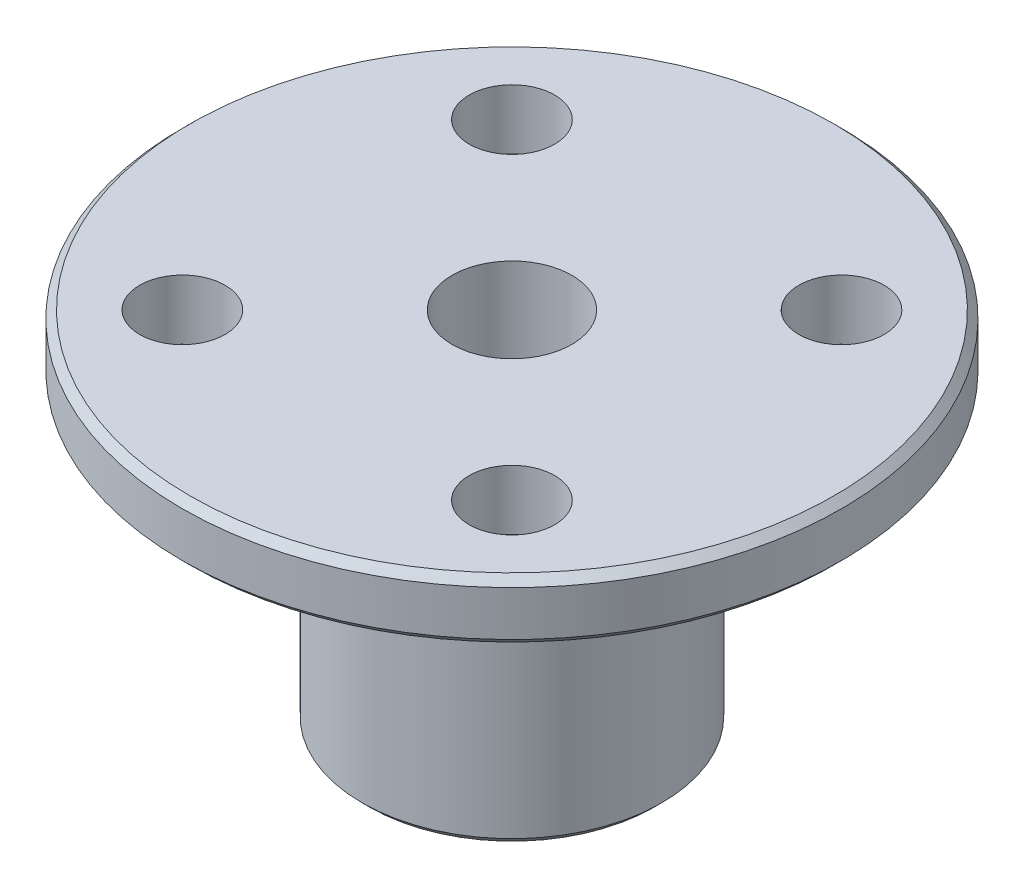
ISO-10303-21;
HEADER;
FILE_DESCRIPTION(('STEP AP214'),'2;1');
FILE_NAME('part.step','',(''),(''),'','','');
FILE_SCHEMA(('AUTOMOTIVE_DESIGN { 1 0 10303 214 1 1 1 1 }'));
ENDSEC;
DATA;
#1=APPLICATION_CONTEXT('core data for automotive mechanical design processes');
#2=APPLICATION_PROTOCOL_DEFINITION('international standard','automotive_design',2000,#1);
#3=PRODUCT_CONTEXT('',#1,'mechanical');
#4=PRODUCT('Part','Part','',(#3));
#5=PRODUCT_RELATED_PRODUCT_CATEGORY('part','',(#4));
#6=PRODUCT_DEFINITION_FORMATION('','',#4);
#7=PRODUCT_DEFINITION_CONTEXT('part definition',#1,'design');
#8=PRODUCT_DEFINITION('design','',#6,#7);
#9=PRODUCT_DEFINITION_SHAPE('','',#8);
#10=(LENGTH_UNIT() NAMED_UNIT(*) SI_UNIT(.MILLI.,.METRE.));
#11=(NAMED_UNIT(*) PLANE_ANGLE_UNIT() SI_UNIT($,.RADIAN.));
#12=(NAMED_UNIT(*) SI_UNIT($,.STERADIAN.) SOLID_ANGLE_UNIT());
#13=UNCERTAINTY_MEASURE_WITH_UNIT(LENGTH_MEASURE(1.E-05),#10,'distance_accuracy_value','');
#14=(GEOMETRIC_REPRESENTATION_CONTEXT(3) GLOBAL_UNCERTAINTY_ASSIGNED_CONTEXT((#13)) GLOBAL_UNIT_ASSIGNED_CONTEXT((#10,
#11,#12)) REPRESENTATION_CONTEXT('',''));
#15=CARTESIAN_POINT('',(0.,0.,0.));
#16=DIRECTION('',(0.,0.,1.));
#17=DIRECTION('',(1.,0.,0.));
#18=AXIS2_PLACEMENT_3D('',#15,#16,#17);
#19=CARTESIAN_POINT('',(0.,-2.,0.));
#20=DIRECTION('',(0.,1.,0.));
#21=DIRECTION('',(0.,0.,1.));
#22=AXIS2_PLACEMENT_3D('',#19,#20,#21);
#23=CYLINDRICAL_SURFACE('',#22,11.);
#24=CARTESIAN_POINT('',(0.,-1.75,0.));
#25=DIRECTION('',(0.,1.,0.));
#26=DIRECTION('',(0.,0.,1.));
#27=AXIS2_PLACEMENT_3D('',#24,#25,#26);
#28=CIRCLE('',#27,11.);
#29=CARTESIAN_POINT('',(0.,-1.75,11.));
#30=VERTEX_POINT('',#29);
#31=EDGE_CURVE('E49',#30,#30,#28,.T.);
#32=ORIENTED_EDGE('',*,*,#31,.T.);
#33=EDGE_LOOP('',(#32));
#34=FACE_BOUND('',#33,.T.);
#35=CARTESIAN_POINT('',(0.,-0.250000000000011,0.));
#36=DIRECTION('',(0.,1.,0.));
#37=DIRECTION('',(0.,0.,1.));
#38=AXIS2_PLACEMENT_3D('',#35,#36,#37);
#39=CIRCLE('',#38,11.);
#40=CARTESIAN_POINT('',(0.,-0.250000000000011,11.));
#41=VERTEX_POINT('',#40);
#42=EDGE_CURVE('E53',#41,#41,#39,.F.);
#43=ORIENTED_EDGE('',*,*,#42,.T.);
#44=EDGE_LOOP('',(#43));
#45=FACE_BOUND('',#44,.T.);
#46=ADVANCED_FACE('F41',(#34,#45),#23,.T.);
#47=CARTESIAN_POINT('',(-5.5,-2.,-5.5));
#48=DIRECTION('',(0.,1.,0.));
#49=DIRECTION('',(0.,0.,1.));
#50=AXIS2_PLACEMENT_3D('',#47,#48,#49);
#51=CYLINDRICAL_SURFACE('',#50,1.425);
#52=CARTESIAN_POINT('',(-5.5,-2.,-5.5));
#53=DIRECTION('',(0.,1.,0.));
#54=DIRECTION('',(0.,0.,1.));
#55=AXIS2_PLACEMENT_3D('',#52,#53,#54);
#56=CIRCLE('',#55,1.425);
#57=CARTESIAN_POINT('',(-5.5,-2.,-4.075));
#58=VERTEX_POINT('',#57);
#59=EDGE_CURVE('E80',#58,#58,#56,.T.);
#60=ORIENTED_EDGE('',*,*,#59,.F.);
#61=EDGE_LOOP('',(#60));
#62=FACE_BOUND('',#61,.T.);
#63=CARTESIAN_POINT('',(-5.5,0.,-5.5));
#64=DIRECTION('',(0.,1.,0.));
#65=DIRECTION('',(0.,0.,1.));
#66=AXIS2_PLACEMENT_3D('',#63,#64,#65);
#67=CIRCLE('',#66,1.425);
#68=CARTESIAN_POINT('',(-5.5,0.,-4.075));
#69=VERTEX_POINT('',#68);
#70=EDGE_CURVE('E85',#69,#69,#67,.T.);
#71=ORIENTED_EDGE('',*,*,#70,.T.);
#72=EDGE_LOOP('',(#71));
#73=FACE_BOUND('',#72,.T.);
#74=ADVANCED_FACE('F142',(#62,#73),#51,.F.);
#75=CARTESIAN_POINT('',(5.5,-2.,5.5));
#76=DIRECTION('',(0.,1.,0.));
#77=DIRECTION('',(0.,0.,1.));
#78=AXIS2_PLACEMENT_3D('',#75,#76,#77);
#79=CYLINDRICAL_SURFACE('',#78,1.425);
#80=CARTESIAN_POINT('',(5.5,-2.,5.5));
#81=DIRECTION('',(0.,1.,0.));
#82=DIRECTION('',(0.,0.,1.));
#83=AXIS2_PLACEMENT_3D('',#80,#81,#82);
#84=CIRCLE('',#83,1.425);
#85=CARTESIAN_POINT('',(5.5,-2.,6.925));
#86=VERTEX_POINT('',#85);
#87=EDGE_CURVE('E99',#86,#86,#84,.T.);
#88=ORIENTED_EDGE('',*,*,#87,.F.);
#89=EDGE_LOOP('',(#88));
#90=FACE_BOUND('',#89,.T.);
#91=CARTESIAN_POINT('',(5.5,0.,5.5));
#92=DIRECTION('',(0.,1.,0.));
#93=DIRECTION('',(0.,0.,1.));
#94=AXIS2_PLACEMENT_3D('',#91,#92,#93);
#95=CIRCLE('',#94,1.425);
#96=CARTESIAN_POINT('',(5.5,0.,6.925));
#97=VERTEX_POINT('',#96);
#98=EDGE_CURVE('E88',#97,#97,#95,.T.);
#99=ORIENTED_EDGE('',*,*,#98,.T.);
#100=EDGE_LOOP('',(#99));
#101=FACE_BOUND('',#100,.T.);
#102=ADVANCED_FACE('F146',(#90,#101),#79,.F.);
#103=CARTESIAN_POINT('',(5.5,-2.,-5.5));
#104=DIRECTION('',(0.,1.,0.));
#105=DIRECTION('',(0.,0.,1.));
#106=AXIS2_PLACEMENT_3D('',#103,#104,#105);
#107=CYLINDRICAL_SURFACE('',#106,1.425);
#108=CARTESIAN_POINT('',(5.5,-2.,-5.5));
#109=DIRECTION('',(0.,1.,0.));
#110=DIRECTION('',(0.,0.,1.));
#111=AXIS2_PLACEMENT_3D('',#108,#109,#110);
#112=CIRCLE('',#111,1.425);
#113=CARTESIAN_POINT('',(5.5,-2.,-4.075));
#114=VERTEX_POINT('',#113);
#115=EDGE_CURVE('E102',#114,#114,#112,.T.);
#116=ORIENTED_EDGE('',*,*,#115,.F.);
#117=EDGE_LOOP('',(#116));
#118=FACE_BOUND('',#117,.T.);
#119=CARTESIAN_POINT('',(5.5,0.,-5.5));
#120=DIRECTION('',(0.,1.,0.));
#121=DIRECTION('',(0.,0.,1.));
#122=AXIS2_PLACEMENT_3D('',#119,#120,#121);
#123=CIRCLE('',#122,1.425);
#124=CARTESIAN_POINT('',(5.5,0.,-4.075));
#125=VERTEX_POINT('',#124);
#126=EDGE_CURVE('E91',#125,#125,#123,.T.);
#127=ORIENTED_EDGE('',*,*,#126,.T.);
#128=EDGE_LOOP('',(#127));
#129=FACE_BOUND('',#128,.T.);
#130=ADVANCED_FACE('F115',(#118,#129),#107,.F.);
#131=CARTESIAN_POINT('',(-5.5,-2.,5.5));
#132=DIRECTION('',(0.,1.,0.));
#133=DIRECTION('',(0.,0.,1.));
#134=AXIS2_PLACEMENT_3D('',#131,#132,#133);
#135=CYLINDRICAL_SURFACE('',#134,1.425);
#136=CARTESIAN_POINT('',(-5.5,-2.,5.5));
#137=DIRECTION('',(0.,1.,0.));
#138=DIRECTION('',(0.,0.,1.));
#139=AXIS2_PLACEMENT_3D('',#136,#137,#138);
#140=CIRCLE('',#139,1.425);
#141=CARTESIAN_POINT('',(-5.5,-2.,6.925));
#142=VERTEX_POINT('',#141);
#143=EDGE_CURVE('E84',#142,#142,#140,.T.);
#144=ORIENTED_EDGE('',*,*,#143,.F.);
#145=EDGE_LOOP('',(#144));
#146=FACE_BOUND('',#145,.T.);
#147=CARTESIAN_POINT('',(-5.5,0.,5.5));
#148=DIRECTION('',(0.,1.,0.));
#149=DIRECTION('',(0.,0.,1.));
#150=AXIS2_PLACEMENT_3D('',#147,#148,#149);
#151=CIRCLE('',#150,1.425);
#152=CARTESIAN_POINT('',(-5.5,0.,6.925));
#153=VERTEX_POINT('',#152);
#154=EDGE_CURVE('E94',#153,#153,#151,.T.);
#155=ORIENTED_EDGE('',*,*,#154,.T.);
#156=EDGE_LOOP('',(#155));
#157=FACE_BOUND('',#156,.T.);
#158=ADVANCED_FACE('F111',(#146,#157),#135,.F.);
#159=CARTESIAN_POINT('',(0.,-2.,0.));
#160=DIRECTION('',(0.,1.,0.));
#161=DIRECTION('',(0.,0.,1.));
#162=AXIS2_PLACEMENT_3D('',#159,#160,#161);
#163=CYLINDRICAL_SURFACE('',#162,2.);
#164=CARTESIAN_POINT('',(0.,-11.75,0.));
#165=DIRECTION('',(0.,1.,0.));
#166=DIRECTION('',(0.,0.,1.));
#167=AXIS2_PLACEMENT_3D('',#164,#165,#166);
#168=CIRCLE('',#167,2.);
#169=CARTESIAN_POINT('',(0.,-11.75,2.));
#170=VERTEX_POINT('',#169);
#171=EDGE_CURVE('E71',#170,#170,#168,.F.);
#172=ORIENTED_EDGE('',*,*,#171,.T.);
#173=EDGE_LOOP('',(#172));
#174=FACE_BOUND('',#173,.T.);
#175=CARTESIAN_POINT('',(0.,0.,0.));
#176=DIRECTION('',(0.,1.,0.));
#177=DIRECTION('',(0.,0.,1.));
#178=AXIS2_PLACEMENT_3D('',#175,#176,#177);
#179=CIRCLE('',#178,2.);
#180=CARTESIAN_POINT('',(0.,0.,2.));
#181=VERTEX_POINT('',#180);
#182=EDGE_CURVE('E81',#181,#181,#179,.T.);
#183=ORIENTED_EDGE('',*,*,#182,.T.);
#184=EDGE_LOOP('',(#183));
#185=FACE_BOUND('',#184,.T.);
#186=ADVANCED_FACE('F114',(#174,#185),#163,.F.);
#187=CARTESIAN_POINT('',(0.,-2.,0.));
#188=DIRECTION('',(0.,1.,0.));
#189=DIRECTION('',(0.,0.,1.));
#190=AXIS2_PLACEMENT_3D('',#187,#188,#189);
#191=PLANE('',#190);
#192=CARTESIAN_POINT('',(0.,-2.,0.));
#193=DIRECTION('',(0.,1.,0.));
#194=DIRECTION('',(0.,0.,1.));
#195=AXIS2_PLACEMENT_3D('',#192,#193,#194);
#196=CIRCLE('',#195,5.25);
#197=CARTESIAN_POINT('',(0.,-2.,5.25));
#198=VERTEX_POINT('',#197);
#199=EDGE_CURVE('E65',#198,#198,#196,.T.);
#200=ORIENTED_EDGE('',*,*,#199,.T.);
#201=EDGE_LOOP('',(#200));
#202=FACE_BOUND('',#201,.T.);
#203=CARTESIAN_POINT('',(0.,-2.,0.));
#204=DIRECTION('',(0.,1.,0.));
#205=DIRECTION('',(0.,0.,1.));
#206=AXIS2_PLACEMENT_3D('',#203,#204,#205);
#207=CIRCLE('',#206,10.75);
#208=CARTESIAN_POINT('',(0.,-2.,10.75));
#209=VERTEX_POINT('',#208);
#210=EDGE_CURVE('E68',#209,#209,#207,.F.);
#211=ORIENTED_EDGE('',*,*,#210,.T.);
#212=EDGE_LOOP('',(#211));
#213=FACE_BOUND('',#212,.T.);
#214=ORIENTED_EDGE('',*,*,#143,.T.);
#215=EDGE_LOOP('',(#214));
#216=FACE_BOUND('',#215,.T.);
#217=ORIENTED_EDGE('',*,*,#115,.T.);
#218=EDGE_LOOP('',(#217));
#219=FACE_BOUND('',#218,.T.);
#220=ORIENTED_EDGE('',*,*,#87,.T.);
#221=EDGE_LOOP('',(#220));
#222=FACE_BOUND('',#221,.T.);
#223=ORIENTED_EDGE('',*,*,#59,.T.);
#224=EDGE_LOOP('',(#223));
#225=FACE_BOUND('',#224,.T.);
#226=ADVANCED_FACE('F108',(#202,#213,#216,#219,#222,#225),#191,.F.);
#227=CARTESIAN_POINT('',(0.,0.,0.));
#228=DIRECTION('',(0.,1.,0.));
#229=DIRECTION('',(0.,0.,1.));
#230=AXIS2_PLACEMENT_3D('',#227,#228,#229);
#231=PLANE('',#230);
#232=CARTESIAN_POINT('',(0.,0.,0.));
#233=DIRECTION('',(0.,1.,0.));
#234=DIRECTION('',(0.,0.,1.));
#235=AXIS2_PLACEMENT_3D('',#232,#233,#234);
#236=CIRCLE('',#235,10.75);
#237=CARTESIAN_POINT('',(0.,0.,10.75));
#238=VERTEX_POINT('',#237);
#239=EDGE_CURVE('E10',#238,#238,#236,.T.);
#240=ORIENTED_EDGE('',*,*,#239,.T.);
#241=EDGE_LOOP('',(#240));
#242=FACE_BOUND('',#241,.T.);
#243=ORIENTED_EDGE('',*,*,#154,.F.);
#244=EDGE_LOOP('',(#243));
#245=FACE_BOUND('',#244,.T.);
#246=ORIENTED_EDGE('',*,*,#126,.F.);
#247=EDGE_LOOP('',(#246));
#248=FACE_BOUND('',#247,.T.);
#249=ORIENTED_EDGE('',*,*,#98,.F.);
#250=EDGE_LOOP('',(#249));
#251=FACE_BOUND('',#250,.T.);
#252=ORIENTED_EDGE('',*,*,#70,.F.);
#253=EDGE_LOOP('',(#252));
#254=FACE_BOUND('',#253,.T.);
#255=ORIENTED_EDGE('',*,*,#182,.F.);
#256=EDGE_LOOP('',(#255));
#257=FACE_BOUND('',#256,.T.);
#258=ADVANCED_FACE('F119',(#242,#245,#248,#251,#254,#257),#231,.T.);
#259=CARTESIAN_POINT('',(0.,-12.,0.));
#260=DIRECTION('',(0.,1.,0.));
#261=DIRECTION('',(0.,0.,1.));
#262=AXIS2_PLACEMENT_3D('',#259,#260,#261);
#263=CYLINDRICAL_SURFACE('',#262,5.);
#264=CARTESIAN_POINT('',(0.,-2.25,0.));
#265=DIRECTION('',(0.,1.,0.));
#266=DIRECTION('',(0.,0.,1.));
#267=AXIS2_PLACEMENT_3D('',#264,#265,#266);
#268=CIRCLE('',#267,5.);
#269=CARTESIAN_POINT('',(0.,-2.25,5.));
#270=VERTEX_POINT('',#269);
#271=EDGE_CURVE('E57',#270,#270,#268,.F.);
#272=ORIENTED_EDGE('',*,*,#271,.T.);
#273=EDGE_LOOP('',(#272));
#274=FACE_BOUND('',#273,.T.);
#275=CARTESIAN_POINT('',(0.,-11.75,0.));
#276=DIRECTION('',(0.,1.,0.));
#277=DIRECTION('',(0.,0.,1.));
#278=AXIS2_PLACEMENT_3D('',#275,#276,#277);
#279=CIRCLE('',#278,5.);
#280=CARTESIAN_POINT('',(0.,-11.75,5.));
#281=VERTEX_POINT('',#280);
#282=EDGE_CURVE('E62',#281,#281,#279,.T.);
#283=ORIENTED_EDGE('',*,*,#282,.T.);
#284=EDGE_LOOP('',(#283));
#285=FACE_BOUND('',#284,.T.);
#286=ADVANCED_FACE('F122',(#274,#285),#263,.T.);
#287=CARTESIAN_POINT('',(0.,-12.,0.));
#288=DIRECTION('',(0.,1.,0.));
#289=DIRECTION('',(0.,0.,1.));
#290=AXIS2_PLACEMENT_3D('',#287,#288,#289);
#291=PLANE('',#290);
#292=CARTESIAN_POINT('',(0.,-12.,0.));
#293=DIRECTION('',(0.,1.,0.));
#294=DIRECTION('',(0.,0.,1.));
#295=AXIS2_PLACEMENT_3D('',#292,#293,#294);
#296=CIRCLE('',#295,2.25);
#297=CARTESIAN_POINT('',(0.,-12.,2.25));
#298=VERTEX_POINT('',#297);
#299=EDGE_CURVE('E74',#298,#298,#296,.T.);
#300=ORIENTED_EDGE('',*,*,#299,.T.);
#301=EDGE_LOOP('',(#300));
#302=FACE_BOUND('',#301,.T.);
#303=CARTESIAN_POINT('',(0.,-12.,0.));
#304=DIRECTION('',(0.,1.,0.));
#305=DIRECTION('',(0.,0.,1.));
#306=AXIS2_PLACEMENT_3D('',#303,#304,#305);
#307=CIRCLE('',#306,4.74999999999999);
#308=CARTESIAN_POINT('',(0.,-12.,4.74999999999999));
#309=VERTEX_POINT('',#308);
#310=EDGE_CURVE('E77',#309,#309,#307,.F.);
#311=ORIENTED_EDGE('',*,*,#310,.T.);
#312=EDGE_LOOP('',(#311));
#313=FACE_BOUND('',#312,.T.);
#314=ADVANCED_FACE('F165',(#302,#313),#291,.F.);
#315=CARTESIAN_POINT('',(0.,-12.,0.));
#316=DIRECTION('',(0.,-1.,0.));
#317=DIRECTION('',(0.,0.,-1.));
#318=AXIS2_PLACEMENT_3D('',#315,#316,#317);
#319=CONICAL_SURFACE('',#318,2.25,0.785398163397448);
#320=ORIENTED_EDGE('',*,*,#171,.F.);
#321=EDGE_LOOP('',(#320));
#322=FACE_BOUND('',#321,.T.);
#323=ORIENTED_EDGE('',*,*,#299,.F.);
#324=EDGE_LOOP('',(#323));
#325=FACE_BOUND('',#324,.T.);
#326=ADVANCED_FACE('F158',(#322,#325),#319,.F.);
#327=CARTESIAN_POINT('',(0.,-2.,0.));
#328=DIRECTION('',(0.,1.,0.));
#329=DIRECTION('',(0.,0.,1.));
#330=AXIS2_PLACEMENT_3D('',#327,#328,#329);
#331=CONICAL_SURFACE('',#330,5.25,0.785398163397454);
#332=ORIENTED_EDGE('',*,*,#271,.F.);
#333=EDGE_LOOP('',(#332));
#334=FACE_BOUND('',#333,.T.);
#335=ORIENTED_EDGE('',*,*,#199,.F.);
#336=EDGE_LOOP('',(#335));
#337=FACE_BOUND('',#336,.T.);
#338=ADVANCED_FACE('F164',(#334,#337),#331,.T.);
#339=CARTESIAN_POINT('',(0.,-11.75,0.));
#340=DIRECTION('',(0.,1.,0.));
#341=DIRECTION('',(0.,0.,1.));
#342=AXIS2_PLACEMENT_3D('',#339,#340,#341);
#343=CONICAL_SURFACE('',#342,5.,0.785398163397453);
#344=ORIENTED_EDGE('',*,*,#310,.F.);
#345=EDGE_LOOP('',(#344));
#346=FACE_BOUND('',#345,.T.);
#347=ORIENTED_EDGE('',*,*,#282,.F.);
#348=EDGE_LOOP('',(#347));
#349=FACE_BOUND('',#348,.T.);
#350=ADVANCED_FACE('F172',(#346,#349),#343,.T.);
#351=CARTESIAN_POINT('',(0.,-1.75,0.));
#352=DIRECTION('',(0.,1.,0.));
#353=DIRECTION('',(0.,0.,1.));
#354=AXIS2_PLACEMENT_3D('',#351,#352,#353);
#355=CONICAL_SURFACE('',#354,11.,0.785398163397455);
#356=ORIENTED_EDGE('',*,*,#210,.F.);
#357=EDGE_LOOP('',(#356));
#358=FACE_BOUND('',#357,.T.);
#359=ORIENTED_EDGE('',*,*,#31,.F.);
#360=EDGE_LOOP('',(#359));
#361=FACE_BOUND('',#360,.T.);
#362=ADVANCED_FACE('F178',(#358,#361),#355,.T.);
#363=CARTESIAN_POINT('',(0.,0.,0.));
#364=DIRECTION('',(0.,-1.,0.));
#365=DIRECTION('',(0.,0.,-1.));
#366=AXIS2_PLACEMENT_3D('',#363,#364,#365);
#367=CONICAL_SURFACE('',#366,10.75,0.785398163397428);
#368=ORIENTED_EDGE('',*,*,#42,.F.);
#369=EDGE_LOOP('',(#368));
#370=FACE_BOUND('',#369,.T.);
#371=ORIENTED_EDGE('',*,*,#239,.F.);
#372=EDGE_LOOP('',(#371));
#373=FACE_BOUND('',#372,.T.);
#374=ADVANCED_FACE('F44',(#370,#373),#367,.T.);
#375=CLOSED_SHELL('',(#46,#74,#102,#130,#158,#186,#226,#258,#286,#314,#326,#338,#350,#362,#374));
#376=MANIFOLD_SOLID_BREP('B2',#375);
#377=ADVANCED_BREP_SHAPE_REPRESENTATION('',(#18,#376),#14);
#378=SHAPE_DEFINITION_REPRESENTATION(#9,#377);
ENDSEC;
END-ISO-10303-21;
